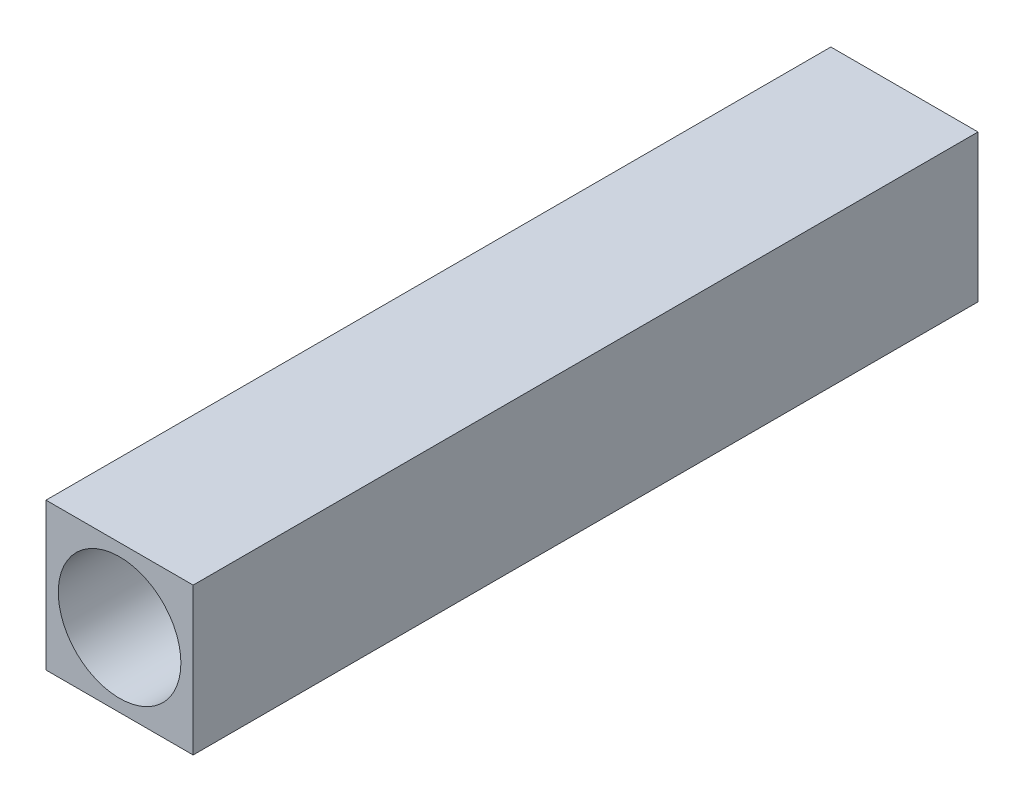
ISO-10303-21;
HEADER;
FILE_DESCRIPTION(('STEP AP214'),'2;1');
FILE_NAME('part.step','',(''),(''),'','','');
FILE_SCHEMA(('AUTOMOTIVE_DESIGN { 1 0 10303 214 1 1 1 1 }'));
ENDSEC;
DATA;
#1=APPLICATION_CONTEXT('core data for automotive mechanical design processes');
#2=APPLICATION_PROTOCOL_DEFINITION('international standard','automotive_design',2000,#1);
#3=PRODUCT_CONTEXT('',#1,'mechanical');
#4=PRODUCT('Part','Part','',(#3));
#5=PRODUCT_RELATED_PRODUCT_CATEGORY('part','',(#4));
#6=PRODUCT_DEFINITION_FORMATION('','',#4);
#7=PRODUCT_DEFINITION_CONTEXT('part definition',#1,'design');
#8=PRODUCT_DEFINITION('design','',#6,#7);
#9=PRODUCT_DEFINITION_SHAPE('','',#8);
#10=(LENGTH_UNIT() NAMED_UNIT(*) SI_UNIT(.MILLI.,.METRE.));
#11=(NAMED_UNIT(*) PLANE_ANGLE_UNIT() SI_UNIT($,.RADIAN.));
#12=(NAMED_UNIT(*) SI_UNIT($,.STERADIAN.) SOLID_ANGLE_UNIT());
#13=UNCERTAINTY_MEASURE_WITH_UNIT(LENGTH_MEASURE(1.E-05),#10,'distance_accuracy_value','');
#14=(GEOMETRIC_REPRESENTATION_CONTEXT(3) GLOBAL_UNCERTAINTY_ASSIGNED_CONTEXT((#13)) GLOBAL_UNIT_ASSIGNED_CONTEXT((#10,
#11,#12)) REPRESENTATION_CONTEXT('',''));
#15=CARTESIAN_POINT('',(0.,0.,0.));
#16=DIRECTION('',(0.,0.,1.));
#17=DIRECTION('',(1.,0.,0.));
#18=AXIS2_PLACEMENT_3D('',#15,#16,#17);
#19=CARTESIAN_POINT('',(0.,38.1,406.4));
#20=DIRECTION('',(0.,-1.,0.));
#21=DIRECTION('',(1.,0.,0.));
#22=AXIS2_PLACEMENT_3D('',#19,#20,#21);
#23=PLANE('',#22);
#24=DIRECTION('',(-1.,0.,0.));
#25=VECTOR('',#24,1.);
#26=CARTESIAN_POINT('',(0.,38.1,0.));
#27=LINE('',#26,#25);
#28=CARTESIAN_POINT('',(38.1,38.1,0.));
#29=VERTEX_POINT('',#28);
#30=CARTESIAN_POINT('',(-38.1,38.1,0.));
#31=VERTEX_POINT('',#30);
#32=EDGE_CURVE('E111',#29,#31,#27,.T.);
#33=ORIENTED_EDGE('',*,*,#32,.T.);
#34=DIRECTION('',(0.,0.,-1.));
#35=VECTOR('',#34,1.);
#36=CARTESIAN_POINT('',(-38.1,38.1,406.4));
#37=LINE('',#36,#35);
#38=CARTESIAN_POINT('',(-38.1,38.1,406.4));
#39=VERTEX_POINT('',#38);
#40=EDGE_CURVE('E11',#39,#31,#37,.T.);
#41=ORIENTED_EDGE('',*,*,#40,.F.);
#42=DIRECTION('',(-1.,0.,0.));
#43=VECTOR('',#42,1.);
#44=CARTESIAN_POINT('',(0.,38.1,406.4));
#45=LINE('',#44,#43);
#46=CARTESIAN_POINT('',(38.1,38.1,406.4));
#47=VERTEX_POINT('',#46);
#48=EDGE_CURVE('E93',#47,#39,#45,.T.);
#49=ORIENTED_EDGE('',*,*,#48,.F.);
#50=DIRECTION('',(0.,0.,-1.));
#51=VECTOR('',#50,1.);
#52=CARTESIAN_POINT('',(38.1,38.1,406.4));
#53=LINE('',#52,#51);
#54=EDGE_CURVE('E60',#47,#29,#53,.T.);
#55=ORIENTED_EDGE('',*,*,#54,.T.);
#56=EDGE_LOOP('',(#33,#41,#49,#55));
#57=FACE_BOUND('',#56,.T.);
#58=ADVANCED_FACE('F43',(#57),#23,.F.);
#59=CARTESIAN_POINT('',(-38.1,0.,406.4));
#60=DIRECTION('',(1.,0.,0.));
#61=DIRECTION('',(0.,1.,0.));
#62=AXIS2_PLACEMENT_3D('',#59,#60,#61);
#63=PLANE('',#62);
#64=DIRECTION('',(0.,-1.,0.));
#65=VECTOR('',#64,1.);
#66=CARTESIAN_POINT('',(-38.1,0.,0.));
#67=LINE('',#66,#65);
#68=CARTESIAN_POINT('',(-38.1,-38.1,0.));
#69=VERTEX_POINT('',#68);
#70=EDGE_CURVE('E99',#31,#69,#67,.T.);
#71=ORIENTED_EDGE('',*,*,#70,.T.);
#72=DIRECTION('',(0.,0.,-1.));
#73=VECTOR('',#72,1.);
#74=CARTESIAN_POINT('',(-38.1,-38.1,406.4));
#75=LINE('',#74,#73);
#76=CARTESIAN_POINT('',(-38.1,-38.1,406.4));
#77=VERTEX_POINT('',#76);
#78=EDGE_CURVE('E52',#77,#69,#75,.T.);
#79=ORIENTED_EDGE('',*,*,#78,.F.);
#80=DIRECTION('',(0.,-1.,0.));
#81=VECTOR('',#80,1.);
#82=CARTESIAN_POINT('',(-38.1,0.,406.4));
#83=LINE('',#82,#81);
#84=EDGE_CURVE('E85',#39,#77,#83,.T.);
#85=ORIENTED_EDGE('',*,*,#84,.F.);
#86=ORIENTED_EDGE('',*,*,#40,.T.);
#87=EDGE_LOOP('',(#71,#79,#85,#86));
#88=FACE_BOUND('',#87,.T.);
#89=ADVANCED_FACE('F98',(#88),#63,.F.);
#90=CARTESIAN_POINT('',(0.,-38.1,406.4));
#91=DIRECTION('',(0.,-1.,0.));
#92=DIRECTION('',(1.,0.,0.));
#93=AXIS2_PLACEMENT_3D('',#90,#91,#92);
#94=PLANE('',#93);
#95=DIRECTION('',(-1.,0.,0.));
#96=VECTOR('',#95,1.);
#97=CARTESIAN_POINT('',(0.,-38.1,0.));
#98=LINE('',#97,#96);
#99=CARTESIAN_POINT('',(38.1,-38.1,0.));
#100=VERTEX_POINT('',#99);
#101=EDGE_CURVE('E117',#100,#69,#98,.T.);
#102=ORIENTED_EDGE('',*,*,#101,.F.);
#103=DIRECTION('',(0.,0.,-1.));
#104=VECTOR('',#103,1.);
#105=CARTESIAN_POINT('',(38.1,-38.1,406.4));
#106=LINE('',#105,#104);
#107=CARTESIAN_POINT('',(38.1,-38.1,406.4));
#108=VERTEX_POINT('',#107);
#109=EDGE_CURVE('E74',#108,#100,#106,.T.);
#110=ORIENTED_EDGE('',*,*,#109,.F.);
#111=DIRECTION('',(-1.,0.,0.));
#112=VECTOR('',#111,1.);
#113=CARTESIAN_POINT('',(0.,-38.1,406.4));
#114=LINE('',#113,#112);
#115=EDGE_CURVE('E92',#108,#77,#114,.T.);
#116=ORIENTED_EDGE('',*,*,#115,.T.);
#117=ORIENTED_EDGE('',*,*,#78,.T.);
#118=EDGE_LOOP('',(#102,#110,#116,#117));
#119=FACE_BOUND('',#118,.T.);
#120=ADVANCED_FACE('F103',(#119),#94,.T.);
#121=CARTESIAN_POINT('',(38.1,0.,406.4));
#122=DIRECTION('',(1.,0.,0.));
#123=DIRECTION('',(0.,1.,0.));
#124=AXIS2_PLACEMENT_3D('',#121,#122,#123);
#125=PLANE('',#124);
#126=DIRECTION('',(0.,-1.,0.));
#127=VECTOR('',#126,1.);
#128=CARTESIAN_POINT('',(38.1,0.,0.));
#129=LINE('',#128,#127);
#130=EDGE_CURVE('E120',#29,#100,#129,.T.);
#131=ORIENTED_EDGE('',*,*,#130,.F.);
#132=ORIENTED_EDGE('',*,*,#54,.F.);
#133=DIRECTION('',(0.,-1.,0.));
#134=VECTOR('',#133,1.);
#135=CARTESIAN_POINT('',(38.1,0.,406.4));
#136=LINE('',#135,#134);
#137=EDGE_CURVE('E105',#47,#108,#136,.T.);
#138=ORIENTED_EDGE('',*,*,#137,.T.);
#139=ORIENTED_EDGE('',*,*,#109,.T.);
#140=EDGE_LOOP('',(#131,#132,#138,#139));
#141=FACE_BOUND('',#140,.T.);
#142=ADVANCED_FACE('F148',(#141),#125,.T.);
#143=CARTESIAN_POINT('',(0.,0.,406.4));
#144=DIRECTION('',(0.,0.,1.));
#145=DIRECTION('',(1.,0.,0.));
#146=AXIS2_PLACEMENT_3D('',#143,#144,#145);
#147=PLANE('',#146);
#148=CARTESIAN_POINT('',(0.,0.,406.4));
#149=DIRECTION('',(0.,0.,1.));
#150=DIRECTION('',(1.,0.,0.));
#151=AXIS2_PLACEMENT_3D('',#148,#149,#150);
#152=CIRCLE('',#151,31.75);
#153=CARTESIAN_POINT('',(31.75,0.,406.4));
#154=VERTEX_POINT('',#153);
#155=EDGE_CURVE('E130',#154,#154,#152,.T.);
#156=ORIENTED_EDGE('',*,*,#155,.F.);
#157=EDGE_LOOP('',(#156));
#158=FACE_BOUND('',#157,.T.);
#159=ORIENTED_EDGE('',*,*,#48,.T.);
#160=ORIENTED_EDGE('',*,*,#84,.T.);
#161=ORIENTED_EDGE('',*,*,#115,.F.);
#162=ORIENTED_EDGE('',*,*,#137,.F.);
#163=EDGE_LOOP('',(#159,#160,#161,#162));
#164=FACE_BOUND('',#163,.T.);
#165=ADVANCED_FACE('F89',(#158,#164),#147,.T.);
#166=CARTESIAN_POINT('',(0.,0.,0.));
#167=DIRECTION('',(0.,0.,1.));
#168=DIRECTION('',(1.,0.,0.));
#169=AXIS2_PLACEMENT_3D('',#166,#167,#168);
#170=PLANE('',#169);
#171=ORIENTED_EDGE('',*,*,#32,.F.);
#172=ORIENTED_EDGE('',*,*,#130,.T.);
#173=ORIENTED_EDGE('',*,*,#101,.T.);
#174=ORIENTED_EDGE('',*,*,#70,.F.);
#175=EDGE_LOOP('',(#171,#172,#173,#174));
#176=FACE_BOUND('',#175,.T.);
#177=ADVANCED_FACE('F143',(#176),#170,.F.);
#178=CARTESIAN_POINT('',(0.,0.,101.6));
#179=DIRECTION('',(0.,0.,1.));
#180=DIRECTION('',(1.,0.,0.));
#181=AXIS2_PLACEMENT_3D('',#178,#179,#180);
#182=CYLINDRICAL_SURFACE('',#181,31.75);
#183=CARTESIAN_POINT('',(0.,0.,101.6));
#184=DIRECTION('',(0.,0.,1.));
#185=DIRECTION('',(1.,0.,0.));
#186=AXIS2_PLACEMENT_3D('',#183,#184,#185);
#187=CIRCLE('',#186,31.75);
#188=CARTESIAN_POINT('',(31.75,0.,101.6));
#189=VERTEX_POINT('',#188);
#190=EDGE_CURVE('E114',#189,#189,#187,.T.);
#191=CARTESIAN_POINT('',(31.75,0.,101.6));
#192=CARTESIAN_POINT('',(31.75,0.,104.775));
#193=CARTESIAN_POINT('',(31.75,0.,107.95));
#194=CARTESIAN_POINT('',(31.75,0.,114.3));
#195=CARTESIAN_POINT('',(31.75,0.,117.475));
#196=CARTESIAN_POINT('',(31.75,0.,123.825));
#197=CARTESIAN_POINT('',(31.75,0.,127.));
#198=CARTESIAN_POINT('',(31.75,0.,133.35));
#199=CARTESIAN_POINT('',(31.75,0.,136.525));
#200=CARTESIAN_POINT('',(31.75,0.,142.875));
#201=CARTESIAN_POINT('',(31.75,0.,146.05));
#202=CARTESIAN_POINT('',(31.75,0.,152.4));
#203=CARTESIAN_POINT('',(31.75,0.,155.575));
#204=CARTESIAN_POINT('',(31.75,0.,161.925));
#205=CARTESIAN_POINT('',(31.75,0.,165.1));
#206=CARTESIAN_POINT('',(31.75,0.,171.45));
#207=CARTESIAN_POINT('',(31.75,0.,174.625));
#208=CARTESIAN_POINT('',(31.75,0.,180.975));
#209=CARTESIAN_POINT('',(31.75,0.,184.15));
#210=CARTESIAN_POINT('',(31.75,0.,190.5));
#211=CARTESIAN_POINT('',(31.75,0.,193.675));
#212=CARTESIAN_POINT('',(31.75,0.,200.025));
#213=CARTESIAN_POINT('',(31.75,0.,203.2));
#214=CARTESIAN_POINT('',(31.75,0.,209.55));
#215=CARTESIAN_POINT('',(31.75,0.,212.725));
#216=CARTESIAN_POINT('',(31.75,0.,219.075));
#217=CARTESIAN_POINT('',(31.75,0.,222.25));
#218=CARTESIAN_POINT('',(31.75,0.,228.6));
#219=CARTESIAN_POINT('',(31.75,0.,231.775));
#220=CARTESIAN_POINT('',(31.75,0.,238.125));
#221=CARTESIAN_POINT('',(31.75,0.,241.3));
#222=CARTESIAN_POINT('',(31.75,0.,247.65));
#223=CARTESIAN_POINT('',(31.75,0.,250.825));
#224=CARTESIAN_POINT('',(31.75,0.,257.175));
#225=CARTESIAN_POINT('',(31.75,0.,260.35));
#226=CARTESIAN_POINT('',(31.75,0.,266.7));
#227=CARTESIAN_POINT('',(31.75,0.,269.875));
#228=CARTESIAN_POINT('',(31.75,0.,276.225));
#229=CARTESIAN_POINT('',(31.75,0.,279.4));
#230=CARTESIAN_POINT('',(31.75,0.,285.75));
#231=CARTESIAN_POINT('',(31.75,0.,288.925));
#232=CARTESIAN_POINT('',(31.75,0.,295.275));
#233=CARTESIAN_POINT('',(31.75,0.,298.45));
#234=CARTESIAN_POINT('',(31.75,0.,304.8));
#235=CARTESIAN_POINT('',(31.75,0.,307.975));
#236=CARTESIAN_POINT('',(31.75,0.,314.325));
#237=CARTESIAN_POINT('',(31.75,0.,317.5));
#238=CARTESIAN_POINT('',(31.75,0.,323.85));
#239=CARTESIAN_POINT('',(31.75,0.,327.025));
#240=CARTESIAN_POINT('',(31.75,0.,333.375));
#241=CARTESIAN_POINT('',(31.75,0.,336.55));
#242=CARTESIAN_POINT('',(31.75,0.,342.9));
#243=CARTESIAN_POINT('',(31.75,0.,346.075));
#244=CARTESIAN_POINT('',(31.75,0.,352.425));
#245=CARTESIAN_POINT('',(31.75,0.,355.6));
#246=CARTESIAN_POINT('',(31.75,0.,361.95));
#247=CARTESIAN_POINT('',(31.75,0.,365.125));
#248=CARTESIAN_POINT('',(31.75,0.,371.475));
#249=CARTESIAN_POINT('',(31.75,0.,374.65));
#250=CARTESIAN_POINT('',(31.75,0.,381.));
#251=CARTESIAN_POINT('',(31.75,0.,384.175));
#252=CARTESIAN_POINT('',(31.75,0.,390.525));
#253=CARTESIAN_POINT('',(31.75,0.,393.7));
#254=CARTESIAN_POINT('',(31.75,0.,400.05));
#255=CARTESIAN_POINT('',(31.75,0.,403.225));
#256=CARTESIAN_POINT('',(31.75,0.,406.4));
#257=B_SPLINE_CURVE_WITH_KNOTS('',3,(#191,#192,#193,#194,#195,#196,#197,#198,#199,#200,#201,
#202,#203,#204,#205,#206,#207,#208,#209,#210,#211,#212,#213,#214,#215,#216,#217,#218,#219,#220,
#221,#222,#223,#224,#225,#226,#227,#228,#229,#230,#231,#232,#233,#234,#235,#236,#237,#238,#239,
#240,#241,#242,#243,#244,#245,#246,#247,#248,#249,#250,#251,#252,#253,#254,#255,#256),
.UNSPECIFIED.,.F.,.F.,(4,2,2,2,2,2,2,2,2,2,2,2,2,2,2,2,2,2,2,2,2,2,2,2,2,2,2,2,2,2,2,2,4),(0.,
9.52499999999999,19.05,28.575,38.1,47.625,57.15,66.675,76.2,85.725,95.25,104.775,114.3,123.825,
133.35,142.875,152.4,161.925,171.45,180.975,190.5,200.025,209.55,219.075,228.6,238.125,247.65,
257.175,266.7,276.225,285.75,295.275,304.8),.UNSPECIFIED.);
#258=EDGE_CURVE('BSEAM140',#189,#154,#257,.T.);
#259=ORIENTED_EDGE('',*,*,#190,.F.);
#260=ORIENTED_EDGE('',*,*,#155,.T.);
#261=ORIENTED_EDGE('',*,*,#258,.T.);
#262=ORIENTED_EDGE('',*,*,#258,.F.);
#263=EDGE_LOOP('',(#259,#261,#260,#262));
#264=FACE_BOUND('',#263,.T.);
#265=ADVANCED_FACE('F140',(#264),#182,.F.);
#266=CARTESIAN_POINT('',(0.,0.,101.6));
#267=DIRECTION('',(0.,0.,1.));
#268=DIRECTION('',(1.,0.,0.));
#269=AXIS2_PLACEMENT_3D('',#266,#267,#268);
#270=PLANE('',#269);
#271=ORIENTED_EDGE('',*,*,#190,.T.);
#272=EDGE_LOOP('',(#271));
#273=FACE_BOUND('',#272,.T.);
#274=ADVANCED_FACE('F138',(#273),#270,.T.);
#275=CLOSED_SHELL('',(#58,#89,#120,#142,#165,#177,#265,#274));
#276=MANIFOLD_SOLID_BREP('B2',#275);
#277=ADVANCED_BREP_SHAPE_REPRESENTATION('',(#18,#276),#14);
#278=SHAPE_DEFINITION_REPRESENTATION(#9,#277);
ENDSEC;
END-ISO-10303-21;
